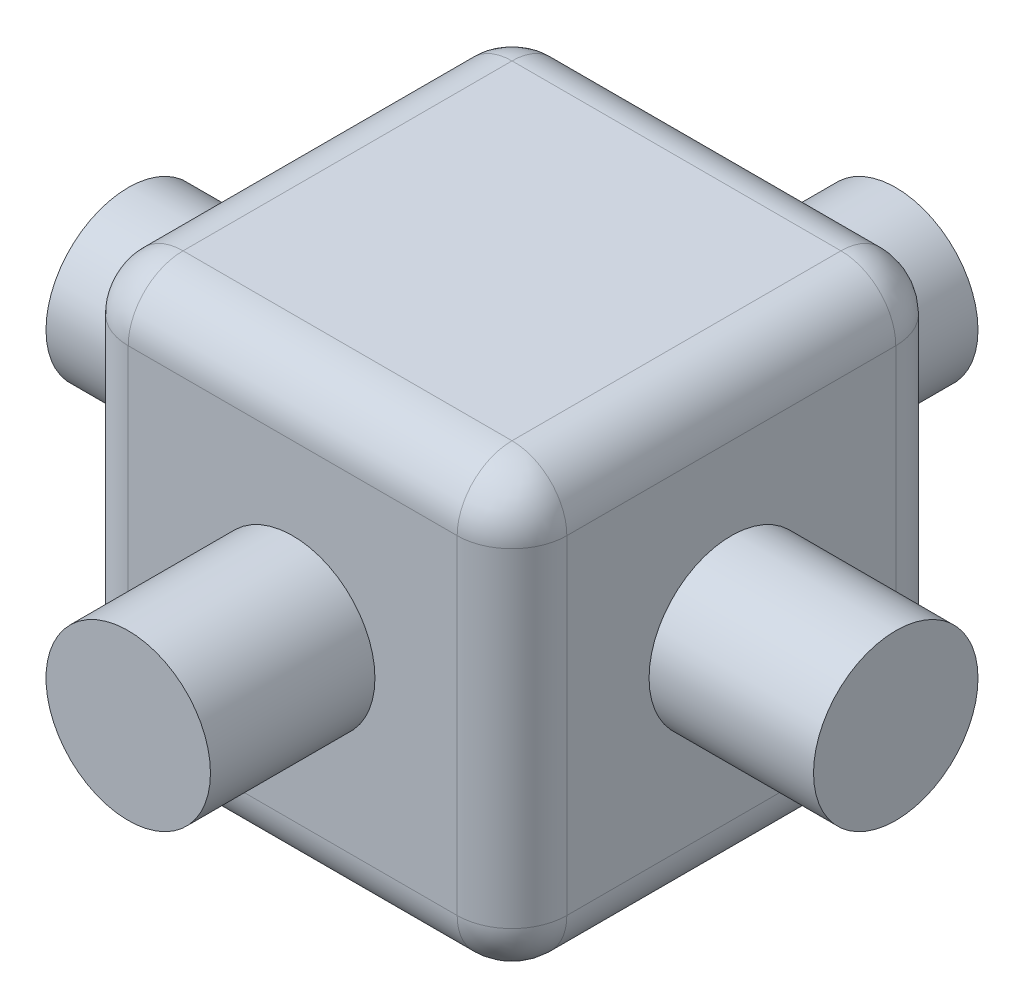
ISO-10303-21;
HEADER;
FILE_DESCRIPTION(('STEP AP214'),'2;1');
FILE_NAME('part.step','',(''),(''),'','','');
FILE_SCHEMA(('AUTOMOTIVE_DESIGN { 1 0 10303 214 1 1 1 1 }'));
ENDSEC;
DATA;
#1=APPLICATION_CONTEXT('core data for automotive mechanical design processes');
#2=APPLICATION_PROTOCOL_DEFINITION('international standard','automotive_design',2000,#1);
#3=PRODUCT_CONTEXT('',#1,'mechanical');
#4=PRODUCT('Part','Part','',(#3));
#5=PRODUCT_RELATED_PRODUCT_CATEGORY('part','',(#4));
#6=PRODUCT_DEFINITION_FORMATION('','',#4);
#7=PRODUCT_DEFINITION_CONTEXT('part definition',#1,'design');
#8=PRODUCT_DEFINITION('design','',#6,#7);
#9=PRODUCT_DEFINITION_SHAPE('','',#8);
#10=(LENGTH_UNIT() NAMED_UNIT(*) SI_UNIT(.MILLI.,.METRE.));
#11=(NAMED_UNIT(*) PLANE_ANGLE_UNIT() SI_UNIT($,.RADIAN.));
#12=(NAMED_UNIT(*) SI_UNIT($,.STERADIAN.) SOLID_ANGLE_UNIT());
#13=UNCERTAINTY_MEASURE_WITH_UNIT(LENGTH_MEASURE(1.E-05),#10,'distance_accuracy_value','');
#14=(GEOMETRIC_REPRESENTATION_CONTEXT(3) GLOBAL_UNCERTAINTY_ASSIGNED_CONTEXT((#13)) GLOBAL_UNIT_ASSIGNED_CONTEXT((#10,
#11,#12)) REPRESENTATION_CONTEXT('',''));
#15=CARTESIAN_POINT('',(0.,0.,0.));
#16=DIRECTION('',(0.,0.,1.));
#17=DIRECTION('',(1.,0.,0.));
#18=AXIS2_PLACEMENT_3D('',#15,#16,#17);
#19=CARTESIAN_POINT('',(0.,0.,3.5));
#20=DIRECTION('',(0.,0.,-1.));
#21=DIRECTION('',(-1.,0.,0.));
#22=AXIS2_PLACEMENT_3D('',#19,#20,#21);
#23=CYLINDRICAL_SURFACE('',#22,0.75);
#24=CARTESIAN_POINT('',(0.,0.,1.99999999999999));
#25=DIRECTION('',(0.,0.,1.));
#26=DIRECTION('',(1.,0.,0.));
#27=AXIS2_PLACEMENT_3D('',#24,#25,#26);
#28=CIRCLE('',#27,0.75);
#29=CARTESIAN_POINT('',(0.75,0.,1.99999999999999));
#30=VERTEX_POINT('',#29);
#31=EDGE_CURVE('E249',#30,#30,#28,.T.);
#32=ORIENTED_EDGE('',*,*,#31,.T.);
#33=EDGE_LOOP('',(#32));
#34=FACE_BOUND('',#33,.T.);
#35=CARTESIAN_POINT('',(0.,0.,3.5));
#36=DIRECTION('',(0.,0.,1.));
#37=DIRECTION('',(1.,0.,0.));
#38=AXIS2_PLACEMENT_3D('',#35,#36,#37);
#39=CIRCLE('',#38,0.75);
#40=CARTESIAN_POINT('',(0.75,0.,3.5));
#41=VERTEX_POINT('',#40);
#42=EDGE_CURVE('E446',#41,#41,#39,.T.);
#43=ORIENTED_EDGE('',*,*,#42,.F.);
#44=EDGE_LOOP('',(#43));
#45=FACE_BOUND('',#44,.T.);
#46=ADVANCED_FACE('F47',(#34,#45),#23,.T.);
#47=CARTESIAN_POINT('',(0.,0.,3.5));
#48=DIRECTION('',(0.,0.,1.));
#49=DIRECTION('',(1.,0.,0.));
#50=AXIS2_PLACEMENT_3D('',#47,#48,#49);
#51=PLANE('',#50);
#52=ORIENTED_EDGE('',*,*,#42,.T.);
#53=EDGE_LOOP('',(#52));
#54=FACE_BOUND('',#53,.T.);
#55=ADVANCED_FACE('F408',(#54),#51,.T.);
#56=CARTESIAN_POINT('',(0.,2.,1.99999999999999));
#57=DIRECTION('',(0.,0.,1.));
#58=DIRECTION('',(1.,0.,0.));
#59=AXIS2_PLACEMENT_3D('',#56,#57,#58);
#60=PLANE('',#59);
#61=DIRECTION('',(0.,-1.,0.));
#62=VECTOR('',#61,1.);
#63=CARTESIAN_POINT('',(-1.5,2.,1.99999999999999));
#64=LINE('',#63,#62);
#65=CARTESIAN_POINT('',(-1.5,1.5,1.99999999999999));
#66=VERTEX_POINT('',#65);
#67=CARTESIAN_POINT('',(-1.5,-1.5,1.99999999999999));
#68=VERTEX_POINT('',#67);
#69=EDGE_CURVE('E72',#66,#68,#64,.T.);
#70=ORIENTED_EDGE('',*,*,#69,.T.);
#71=DIRECTION('',(-1.,0.,0.));
#72=VECTOR('',#71,1.);
#73=CARTESIAN_POINT('',(2.,-1.5,1.99999999999999));
#74=LINE('',#73,#72);
#75=CARTESIAN_POINT('',(1.5,-1.5,1.99999999999999));
#76=VERTEX_POINT('',#75);
#77=EDGE_CURVE('E11',#68,#76,#74,.F.);
#78=ORIENTED_EDGE('',*,*,#77,.T.);
#79=DIRECTION('',(0.,-1.,0.));
#80=VECTOR('',#79,1.);
#81=CARTESIAN_POINT('',(1.5,2.,1.99999999999999));
#82=LINE('',#81,#80);
#83=CARTESIAN_POINT('',(1.5,1.5,1.99999999999999));
#84=VERTEX_POINT('',#83);
#85=EDGE_CURVE('E57',#76,#84,#82,.F.);
#86=ORIENTED_EDGE('',*,*,#85,.T.);
#87=DIRECTION('',(-1.,0.,0.));
#88=VECTOR('',#87,1.);
#89=CARTESIAN_POINT('',(0.,1.5,1.99999999999999));
#90=LINE('',#89,#88);
#91=EDGE_CURVE('E315',#84,#66,#90,.T.);
#92=ORIENTED_EDGE('',*,*,#91,.T.);
#93=EDGE_LOOP('',(#70,#78,#86,#92));
#94=FACE_BOUND('',#93,.T.);
#95=ORIENTED_EDGE('',*,*,#31,.F.);
#96=EDGE_LOOP('',(#95));
#97=FACE_BOUND('',#96,.T.);
#98=ADVANCED_FACE('F387',(#94,#97),#60,.T.);
#99=CARTESIAN_POINT('',(2.,2.,0.));
#100=DIRECTION('',(-1.,0.,0.));
#101=DIRECTION('',(0.,0.,1.));
#102=AXIS2_PLACEMENT_3D('',#99,#100,#101);
#103=PLANE('',#102);
#104=DIRECTION('',(0.,-1.,0.));
#105=VECTOR('',#104,1.);
#106=CARTESIAN_POINT('',(2.,-2.,1.49999999999999));
#107=LINE('',#106,#105);
#108=CARTESIAN_POINT('',(2.,1.5,1.49999999999999));
#109=VERTEX_POINT('',#108);
#110=CARTESIAN_POINT('',(2.,-1.5,1.49999999999999));
#111=VERTEX_POINT('',#110);
#112=EDGE_CURVE('E153',#109,#111,#107,.T.);
#113=ORIENTED_EDGE('',*,*,#112,.T.);
#114=DIRECTION('',(0.,0.,-1.));
#115=VECTOR('',#114,1.);
#116=CARTESIAN_POINT('',(2.,-1.5,0.));
#117=LINE('',#116,#115);
#118=CARTESIAN_POINT('',(2.,-1.5,-1.49999999999999));
#119=VERTEX_POINT('',#118);
#120=EDGE_CURVE('E148',#111,#119,#117,.T.);
#121=ORIENTED_EDGE('',*,*,#120,.T.);
#122=DIRECTION('',(0.,-1.,0.));
#123=VECTOR('',#122,1.);
#124=CARTESIAN_POINT('',(2.,2.,-1.49999999999999));
#125=LINE('',#124,#123);
#126=CARTESIAN_POINT('',(2.,1.5,-1.49999999999999));
#127=VERTEX_POINT('',#126);
#128=EDGE_CURVE('E141',#119,#127,#125,.F.);
#129=ORIENTED_EDGE('',*,*,#128,.T.);
#130=DIRECTION('',(0.,0.,-1.));
#131=VECTOR('',#130,1.);
#132=CARTESIAN_POINT('',(2.,1.5,1.99999999999999));
#133=LINE('',#132,#131);
#134=EDGE_CURVE('E145',#127,#109,#133,.F.);
#135=ORIENTED_EDGE('',*,*,#134,.T.);
#136=EDGE_LOOP('',(#113,#121,#129,#135));
#137=FACE_BOUND('',#136,.T.);
#138=CARTESIAN_POINT('',(2.,0.,0.));
#139=DIRECTION('',(-1.,0.,0.));
#140=DIRECTION('',(0.,0.,1.));
#141=AXIS2_PLACEMENT_3D('',#138,#139,#140);
#142=CIRCLE('',#141,0.75);
#143=CARTESIAN_POINT('',(2.,0.,0.749999999999993));
#144=VERTEX_POINT('',#143);
#145=EDGE_CURVE('E443',#144,#144,#142,.T.);
#146=ORIENTED_EDGE('',*,*,#145,.T.);
#147=EDGE_LOOP('',(#146));
#148=FACE_BOUND('',#147,.T.);
#149=ADVANCED_FACE('F143',(#137,#148),#103,.F.);
#150=CARTESIAN_POINT('',(0.,2.,-1.99999999999999));
#151=DIRECTION('',(0.,0.,1.));
#152=DIRECTION('',(1.,0.,0.));
#153=AXIS2_PLACEMENT_3D('',#150,#151,#152);
#154=PLANE('',#153);
#155=DIRECTION('',(0.,-1.,0.));
#156=VECTOR('',#155,1.);
#157=CARTESIAN_POINT('',(1.5,2.,-1.99999999999999));
#158=LINE('',#157,#156);
#159=CARTESIAN_POINT('',(1.5,1.5,-1.99999999999999));
#160=VERTEX_POINT('',#159);
#161=CARTESIAN_POINT('',(1.5,-1.5,-1.99999999999999));
#162=VERTEX_POINT('',#161);
#163=EDGE_CURVE('E178',#160,#162,#158,.T.);
#164=ORIENTED_EDGE('',*,*,#163,.T.);
#165=DIRECTION('',(-1.,0.,0.));
#166=VECTOR('',#165,1.);
#167=CARTESIAN_POINT('',(0.,-1.5,-1.99999999999999));
#168=LINE('',#167,#166);
#169=CARTESIAN_POINT('',(-1.5,-1.5,-1.99999999999999));
#170=VERTEX_POINT('',#169);
#171=EDGE_CURVE('E285',#162,#170,#168,.T.);
#172=ORIENTED_EDGE('',*,*,#171,.T.);
#173=DIRECTION('',(0.,-1.,0.));
#174=VECTOR('',#173,1.);
#175=CARTESIAN_POINT('',(-1.5,2.,-1.99999999999999));
#176=LINE('',#175,#174);
#177=CARTESIAN_POINT('',(-1.5,1.5,-1.99999999999999));
#178=VERTEX_POINT('',#177);
#179=EDGE_CURVE('E282',#170,#178,#176,.F.);
#180=ORIENTED_EDGE('',*,*,#179,.T.);
#181=DIRECTION('',(-1.,0.,0.));
#182=VECTOR('',#181,1.);
#183=CARTESIAN_POINT('',(2.,1.5,-1.99999999999999));
#184=LINE('',#183,#182);
#185=EDGE_CURVE('E277',#178,#160,#184,.F.);
#186=ORIENTED_EDGE('',*,*,#185,.T.);
#187=EDGE_LOOP('',(#164,#172,#180,#186));
#188=FACE_BOUND('',#187,.T.);
#189=CARTESIAN_POINT('',(0.,0.,-1.99999999999999));
#190=DIRECTION('',(0.,0.,1.));
#191=DIRECTION('',(1.,0.,0.));
#192=AXIS2_PLACEMENT_3D('',#189,#190,#191);
#193=CIRCLE('',#192,0.75);
#194=CARTESIAN_POINT('',(0.75,0.,-1.99999999999999));
#195=VERTEX_POINT('',#194);
#196=EDGE_CURVE('E166',#195,#195,#193,.T.);
#197=ORIENTED_EDGE('',*,*,#196,.T.);
#198=EDGE_LOOP('',(#197));
#199=FACE_BOUND('',#198,.T.);
#200=ADVANCED_FACE('F361',(#188,#199),#154,.F.);
#201=CARTESIAN_POINT('',(-2.,2.,0.));
#202=DIRECTION('',(-1.,0.,0.));
#203=DIRECTION('',(0.,0.,1.));
#204=AXIS2_PLACEMENT_3D('',#201,#202,#203);
#205=PLANE('',#204);
#206=DIRECTION('',(0.,0.,-1.));
#207=VECTOR('',#206,1.);
#208=CARTESIAN_POINT('',(-2.,1.5,0.));
#209=LINE('',#208,#207);
#210=CARTESIAN_POINT('',(-2.,1.5,1.49999999999999));
#211=VERTEX_POINT('',#210);
#212=CARTESIAN_POINT('',(-2.,1.5,-1.49999999999999));
#213=VERTEX_POINT('',#212);
#214=EDGE_CURVE('E295',#211,#213,#209,.T.);
#215=ORIENTED_EDGE('',*,*,#214,.T.);
#216=DIRECTION('',(0.,-1.,0.));
#217=VECTOR('',#216,1.);
#218=CARTESIAN_POINT('',(-2.,-2.,-1.49999999999999));
#219=LINE('',#218,#217);
#220=CARTESIAN_POINT('',(-2.,-1.5,-1.49999999999999));
#221=VERTEX_POINT('',#220);
#222=EDGE_CURVE('E298',#213,#221,#219,.T.);
#223=ORIENTED_EDGE('',*,*,#222,.T.);
#224=DIRECTION('',(0.,0.,-1.));
#225=VECTOR('',#224,1.);
#226=CARTESIAN_POINT('',(-2.,-1.5,1.99999999999999));
#227=LINE('',#226,#225);
#228=CARTESIAN_POINT('',(-2.,-1.5,1.49999999999999));
#229=VERTEX_POINT('',#228);
#230=EDGE_CURVE('E292',#221,#229,#227,.F.);
#231=ORIENTED_EDGE('',*,*,#230,.T.);
#232=DIRECTION('',(0.,-1.,0.));
#233=VECTOR('',#232,1.);
#234=CARTESIAN_POINT('',(-2.,2.,1.49999999999999));
#235=LINE('',#234,#233);
#236=EDGE_CURVE('E289',#229,#211,#235,.F.);
#237=ORIENTED_EDGE('',*,*,#236,.T.);
#238=EDGE_LOOP('',(#215,#223,#231,#237));
#239=FACE_BOUND('',#238,.T.);
#240=CARTESIAN_POINT('',(-2.,0.,0.));
#241=DIRECTION('',(-1.,0.,0.));
#242=DIRECTION('',(0.,0.,1.));
#243=AXIS2_PLACEMENT_3D('',#240,#241,#242);
#244=CIRCLE('',#243,0.75);
#245=CARTESIAN_POINT('',(-2.,0.,0.750000000000007));
#246=VERTEX_POINT('',#245);
#247=EDGE_CURVE('E242',#246,#246,#244,.T.);
#248=ORIENTED_EDGE('',*,*,#247,.F.);
#249=EDGE_LOOP('',(#248));
#250=FACE_BOUND('',#249,.T.);
#251=ADVANCED_FACE('F374',(#239,#250),#205,.T.);
#252=CARTESIAN_POINT('',(0.,2.,0.));
#253=DIRECTION('',(0.,1.,0.));
#254=DIRECTION('',(0.,0.,1.));
#255=AXIS2_PLACEMENT_3D('',#252,#253,#254);
#256=PLANE('',#255);
#257=DIRECTION('',(-1.,0.,0.));
#258=VECTOR('',#257,1.);
#259=CARTESIAN_POINT('',(-2.,2.,-1.49999999999999));
#260=LINE('',#259,#258);
#261=CARTESIAN_POINT('',(1.5,2.,-1.49999999999999));
#262=VERTEX_POINT('',#261);
#263=CARTESIAN_POINT('',(-1.5,2.,-1.49999999999999));
#264=VERTEX_POINT('',#263);
#265=EDGE_CURVE('E305',#262,#264,#260,.T.);
#266=ORIENTED_EDGE('',*,*,#265,.T.);
#267=DIRECTION('',(0.,0.,-1.));
#268=VECTOR('',#267,1.);
#269=CARTESIAN_POINT('',(-1.5,2.,0.));
#270=LINE('',#269,#268);
#271=CARTESIAN_POINT('',(-1.5,2.,1.49999999999999));
#272=VERTEX_POINT('',#271);
#273=EDGE_CURVE('E311',#264,#272,#270,.F.);
#274=ORIENTED_EDGE('',*,*,#273,.T.);
#275=DIRECTION('',(-1.,0.,0.));
#276=VECTOR('',#275,1.);
#277=CARTESIAN_POINT('',(0.,2.,1.49999999999999));
#278=LINE('',#277,#276);
#279=CARTESIAN_POINT('',(1.5,2.,1.49999999999999));
#280=VERTEX_POINT('',#279);
#281=EDGE_CURVE('E308',#272,#280,#278,.F.);
#282=ORIENTED_EDGE('',*,*,#281,.T.);
#283=DIRECTION('',(0.,0.,-1.));
#284=VECTOR('',#283,1.);
#285=CARTESIAN_POINT('',(1.5,2.,-1.99999999999999));
#286=LINE('',#285,#284);
#287=EDGE_CURVE('E302',#280,#262,#286,.T.);
#288=ORIENTED_EDGE('',*,*,#287,.T.);
#289=EDGE_LOOP('',(#266,#274,#282,#288));
#290=FACE_BOUND('',#289,.T.);
#291=ADVANCED_FACE('F370',(#290),#256,.T.);
#292=CARTESIAN_POINT('',(0.,-2.,0.));
#293=DIRECTION('',(0.,1.,0.));
#294=DIRECTION('',(0.,0.,1.));
#295=AXIS2_PLACEMENT_3D('',#292,#293,#294);
#296=PLANE('',#295);
#297=DIRECTION('',(-1.,0.,0.));
#298=VECTOR('',#297,1.);
#299=CARTESIAN_POINT('',(0.,-2.,-1.49999999999999));
#300=LINE('',#299,#298);
#301=CARTESIAN_POINT('',(-1.5,-2.,-1.49999999999999));
#302=VERTEX_POINT('',#301);
#303=CARTESIAN_POINT('',(1.5,-2.,-1.49999999999999));
#304=VERTEX_POINT('',#303);
#305=EDGE_CURVE('E270',#302,#304,#300,.F.);
#306=ORIENTED_EDGE('',*,*,#305,.T.);
#307=DIRECTION('',(0.,0.,-1.));
#308=VECTOR('',#307,1.);
#309=CARTESIAN_POINT('',(1.5,-2.,0.));
#310=LINE('',#309,#308);
#311=CARTESIAN_POINT('',(1.5,-2.,1.49999999999999));
#312=VERTEX_POINT('',#311);
#313=EDGE_CURVE('E273',#304,#312,#310,.F.);
#314=ORIENTED_EDGE('',*,*,#313,.T.);
#315=DIRECTION('',(-1.,0.,0.));
#316=VECTOR('',#315,1.);
#317=CARTESIAN_POINT('',(-2.,-2.,1.49999999999999));
#318=LINE('',#317,#316);
#319=CARTESIAN_POINT('',(-1.5,-2.,1.49999999999999));
#320=VERTEX_POINT('',#319);
#321=EDGE_CURVE('E264',#312,#320,#318,.T.);
#322=ORIENTED_EDGE('',*,*,#321,.T.);
#323=DIRECTION('',(0.,0.,-1.));
#324=VECTOR('',#323,1.);
#325=CARTESIAN_POINT('',(-1.5,-2.,-1.99999999999999));
#326=LINE('',#325,#324);
#327=EDGE_CURVE('E267',#320,#302,#326,.T.);
#328=ORIENTED_EDGE('',*,*,#327,.T.);
#329=EDGE_LOOP('',(#306,#314,#322,#328));
#330=FACE_BOUND('',#329,.T.);
#331=ADVANCED_FACE('F348',(#330),#296,.F.);
#332=CARTESIAN_POINT('',(3.5,0.,0.));
#333=DIRECTION('',(1.,0.,0.));
#334=DIRECTION('',(0.,0.,-1.));
#335=AXIS2_PLACEMENT_3D('',#332,#333,#334);
#336=PLANE('',#335);
#337=CARTESIAN_POINT('',(3.5,0.,0.));
#338=DIRECTION('',(1.,0.,0.));
#339=DIRECTION('',(0.,0.,-1.));
#340=AXIS2_PLACEMENT_3D('',#337,#338,#339);
#341=CIRCLE('',#340,0.75);
#342=CARTESIAN_POINT('',(3.5,0.,-0.750000000000012));
#343=VERTEX_POINT('',#342);
#344=EDGE_CURVE('E453',#343,#343,#341,.T.);
#345=ORIENTED_EDGE('',*,*,#344,.T.);
#346=EDGE_LOOP('',(#345));
#347=FACE_BOUND('',#346,.T.);
#348=ADVANCED_FACE('F462',(#347),#336,.T.);
#349=CARTESIAN_POINT('',(3.5,0.,0.));
#350=DIRECTION('',(-1.,0.,0.));
#351=DIRECTION('',(0.,0.,1.));
#352=AXIS2_PLACEMENT_3D('',#349,#350,#351);
#353=CYLINDRICAL_SURFACE('',#352,0.75);
#354=ORIENTED_EDGE('',*,*,#344,.F.);
#355=EDGE_LOOP('',(#354));
#356=FACE_BOUND('',#355,.T.);
#357=ORIENTED_EDGE('',*,*,#145,.F.);
#358=EDGE_LOOP('',(#357));
#359=FACE_BOUND('',#358,.T.);
#360=ADVANCED_FACE('F434',(#356,#359),#353,.T.);
#361=CARTESIAN_POINT('',(0.,0.,-3.5));
#362=DIRECTION('',(0.,0.,1.));
#363=DIRECTION('',(1.,0.,0.));
#364=AXIS2_PLACEMENT_3D('',#361,#362,#363);
#365=PLANE('',#364);
#366=CARTESIAN_POINT('',(0.,0.,-3.5));
#367=DIRECTION('',(0.,0.,1.));
#368=DIRECTION('',(1.,0.,0.));
#369=AXIS2_PLACEMENT_3D('',#366,#367,#368);
#370=CIRCLE('',#369,0.75);
#371=CARTESIAN_POINT('',(0.75,0.,-3.5));
#372=VERTEX_POINT('',#371);
#373=EDGE_CURVE('E439',#372,#372,#370,.T.);
#374=ORIENTED_EDGE('',*,*,#373,.F.);
#375=EDGE_LOOP('',(#374));
#376=FACE_BOUND('',#375,.T.);
#377=ADVANCED_FACE('F424',(#376),#365,.F.);
#378=ORIENTED_EDGE('',*,*,#373,.T.);
#379=EDGE_LOOP('',(#378));
#380=FACE_BOUND('',#379,.T.);
#381=ORIENTED_EDGE('',*,*,#196,.F.);
#382=EDGE_LOOP('',(#381));
#383=FACE_BOUND('',#382,.T.);
#384=ADVANCED_FACE('F411',(#380,#383),#23,.T.);
#385=CARTESIAN_POINT('',(-3.5,0.,0.));
#386=DIRECTION('',(1.,0.,0.));
#387=DIRECTION('',(0.,0.,-1.));
#388=AXIS2_PLACEMENT_3D('',#385,#386,#387);
#389=PLANE('',#388);
#390=CARTESIAN_POINT('',(-3.5,0.,0.));
#391=DIRECTION('',(1.,0.,0.));
#392=DIRECTION('',(0.,0.,-1.));
#393=AXIS2_PLACEMENT_3D('',#390,#391,#392);
#394=CIRCLE('',#393,0.75);
#395=CARTESIAN_POINT('',(-3.5,0.,-0.749999999999988));
#396=VERTEX_POINT('',#395);
#397=EDGE_CURVE('E255',#396,#396,#394,.T.);
#398=ORIENTED_EDGE('',*,*,#397,.F.);
#399=EDGE_LOOP('',(#398));
#400=FACE_BOUND('',#399,.T.);
#401=ADVANCED_FACE('F423',(#400),#389,.F.);
#402=ORIENTED_EDGE('',*,*,#247,.T.);
#403=EDGE_LOOP('',(#402));
#404=FACE_BOUND('',#403,.T.);
#405=ORIENTED_EDGE('',*,*,#397,.T.);
#406=EDGE_LOOP('',(#405));
#407=FACE_BOUND('',#406,.T.);
#408=ADVANCED_FACE('F430',(#404,#407),#353,.T.);
#409=CARTESIAN_POINT('',(-1.5,1.5,0.));
#410=DIRECTION('',(0.,0.,-1.));
#411=DIRECTION('',(-1.,0.,0.));
#412=AXIS2_PLACEMENT_3D('',#409,#410,#411);
#413=CYLINDRICAL_SURFACE('',#412,0.5);
#414=CARTESIAN_POINT('',(-1.5,1.5,1.49999999999999));
#415=DIRECTION('',(0.,0.,1.));
#416=DIRECTION('',(1.,0.,0.));
#417=AXIS2_PLACEMENT_3D('',#414,#415,#416);
#418=CIRCLE('',#417,0.5);
#419=EDGE_CURVE('E51',#272,#211,#418,.T.);
#420=ORIENTED_EDGE('',*,*,#419,.F.);
#421=ORIENTED_EDGE('',*,*,#273,.F.);
#422=CARTESIAN_POINT('',(-1.5,1.5,-1.49999999999999));
#423=DIRECTION('',(0.,0.,-1.));
#424=DIRECTION('',(-1.,0.,0.));
#425=AXIS2_PLACEMENT_3D('',#422,#423,#424);
#426=CIRCLE('',#425,0.5);
#427=EDGE_CURVE('E233',#213,#264,#426,.T.);
#428=ORIENTED_EDGE('',*,*,#427,.F.);
#429=ORIENTED_EDGE('',*,*,#214,.F.);
#430=EDGE_LOOP('',(#420,#421,#428,#429));
#431=FACE_BOUND('',#430,.T.);
#432=ADVANCED_FACE('F49',(#431),#413,.T.);
#433=CARTESIAN_POINT('',(-1.5,1.5,1.49999999999999));
#434=DIRECTION('',(-1.,0.,0.));
#435=DIRECTION('',(0.,0.,1.));
#436=AXIS2_PLACEMENT_3D('',#433,#434,#435);
#437=SPHERICAL_SURFACE('',#436,0.5);
#438=CARTESIAN_POINT('',(-1.5,1.5,1.49999999999999));
#439=DIRECTION('',(-1.,0.,0.));
#440=DIRECTION('',(0.,0.,1.));
#441=AXIS2_PLACEMENT_3D('',#438,#439,#440);
#442=CIRCLE('',#441,0.5);
#443=EDGE_CURVE('E226',#272,#66,#442,.F.);
#444=ORIENTED_EDGE('',*,*,#443,.F.);
#445=ORIENTED_EDGE('',*,*,#419,.T.);
#446=CARTESIAN_POINT('',(-1.5,1.5,1.49999999999999));
#447=DIRECTION('',(0.,1.,0.));
#448=DIRECTION('',(0.,0.,1.));
#449=AXIS2_PLACEMENT_3D('',#446,#447,#448);
#450=CIRCLE('',#449,0.5);
#451=EDGE_CURVE('E230',#66,#211,#450,.F.);
#452=ORIENTED_EDGE('',*,*,#451,.F.);
#453=EDGE_LOOP('',(#444,#445,#452));
#454=FACE_BOUND('',#453,.T.);
#455=ADVANCED_FACE('F473',(#454),#437,.T.);
#456=CARTESIAN_POINT('',(-1.5,1.5,-1.49999999999999));
#457=DIRECTION('',(0.,1.,0.));
#458=DIRECTION('',(0.,0.,1.));
#459=AXIS2_PLACEMENT_3D('',#456,#457,#458);
#460=SPHERICAL_SURFACE('',#459,0.5);
#461=CARTESIAN_POINT('',(-1.5,1.5,-1.49999999999999));
#462=DIRECTION('',(0.,1.,0.));
#463=DIRECTION('',(0.,0.,1.));
#464=AXIS2_PLACEMENT_3D('',#461,#462,#463);
#465=CIRCLE('',#464,0.5);
#466=EDGE_CURVE('E218',#213,#178,#465,.F.);
#467=ORIENTED_EDGE('',*,*,#466,.F.);
#468=ORIENTED_EDGE('',*,*,#427,.T.);
#469=CARTESIAN_POINT('',(-1.5,1.5,-1.49999999999999));
#470=DIRECTION('',(-1.,0.,0.));
#471=DIRECTION('',(0.,0.,1.));
#472=AXIS2_PLACEMENT_3D('',#469,#470,#471);
#473=CIRCLE('',#472,0.5);
#474=EDGE_CURVE('E222',#178,#264,#473,.F.);
#475=ORIENTED_EDGE('',*,*,#474,.F.);
#476=EDGE_LOOP('',(#467,#468,#475));
#477=FACE_BOUND('',#476,.T.);
#478=ADVANCED_FACE('F480',(#477),#460,.T.);
#479=CARTESIAN_POINT('',(-1.5,2.,1.49999999999999));
#480=DIRECTION('',(0.,-1.,0.));
#481=DIRECTION('',(0.,0.,-1.));
#482=AXIS2_PLACEMENT_3D('',#479,#480,#481);
#483=CYLINDRICAL_SURFACE('',#482,0.5);
#484=ORIENTED_EDGE('',*,*,#451,.T.);
#485=ORIENTED_EDGE('',*,*,#236,.F.);
#486=CARTESIAN_POINT('',(-1.5,-1.5,1.49999999999999));
#487=DIRECTION('',(0.,-1.,0.));
#488=DIRECTION('',(0.,0.,-1.));
#489=AXIS2_PLACEMENT_3D('',#486,#487,#488);
#490=CIRCLE('',#489,0.5);
#491=EDGE_CURVE('E210',#68,#229,#490,.T.);
#492=ORIENTED_EDGE('',*,*,#491,.F.);
#493=ORIENTED_EDGE('',*,*,#69,.F.);
#494=EDGE_LOOP('',(#484,#485,#492,#493));
#495=FACE_BOUND('',#494,.T.);
#496=ADVANCED_FACE('F381',(#495),#483,.T.);
#497=CARTESIAN_POINT('',(0.,1.5,1.49999999999999));
#498=DIRECTION('',(-1.,0.,0.));
#499=DIRECTION('',(0.,0.,1.));
#500=AXIS2_PLACEMENT_3D('',#497,#498,#499);
#501=CYLINDRICAL_SURFACE('',#500,0.5);
#502=ORIENTED_EDGE('',*,*,#443,.T.);
#503=ORIENTED_EDGE('',*,*,#91,.F.);
#504=CARTESIAN_POINT('',(1.5,1.5,1.49999999999999));
#505=DIRECTION('',(1.,0.,0.));
#506=DIRECTION('',(0.,0.,-1.));
#507=AXIS2_PLACEMENT_3D('',#504,#505,#506);
#508=CIRCLE('',#507,0.5);
#509=EDGE_CURVE('E206',#280,#84,#508,.T.);
#510=ORIENTED_EDGE('',*,*,#509,.F.);
#511=ORIENTED_EDGE('',*,*,#281,.F.);
#512=EDGE_LOOP('',(#502,#503,#510,#511));
#513=FACE_BOUND('',#512,.T.);
#514=ADVANCED_FACE('F393',(#513),#501,.T.);
#515=CARTESIAN_POINT('',(1.5,1.5,0.));
#516=DIRECTION('',(0.,0.,1.));
#517=DIRECTION('',(1.,0.,0.));
#518=AXIS2_PLACEMENT_3D('',#515,#516,#517);
#519=CYLINDRICAL_SURFACE('',#518,0.5);
#520=CARTESIAN_POINT('',(1.5,1.5,-1.49999999999999));
#521=DIRECTION('',(0.,0.,-1.));
#522=DIRECTION('',(-1.,0.,0.));
#523=AXIS2_PLACEMENT_3D('',#520,#521,#522);
#524=CIRCLE('',#523,0.5);
#525=EDGE_CURVE('E160',#262,#127,#524,.T.);
#526=ORIENTED_EDGE('',*,*,#525,.F.);
#527=ORIENTED_EDGE('',*,*,#287,.F.);
#528=CARTESIAN_POINT('',(1.5,1.5,1.49999999999999));
#529=DIRECTION('',(0.,0.,1.));
#530=DIRECTION('',(1.,0.,0.));
#531=AXIS2_PLACEMENT_3D('',#528,#529,#530);
#532=CIRCLE('',#531,0.5);
#533=EDGE_CURVE('E163',#109,#280,#532,.T.);
#534=ORIENTED_EDGE('',*,*,#533,.F.);
#535=ORIENTED_EDGE('',*,*,#134,.F.);
#536=EDGE_LOOP('',(#526,#527,#534,#535));
#537=FACE_BOUND('',#536,.T.);
#538=ADVANCED_FACE('F158',(#537),#519,.T.);
#539=CARTESIAN_POINT('',(0.,1.5,-1.49999999999999));
#540=DIRECTION('',(1.,0.,0.));
#541=DIRECTION('',(0.,0.,-1.));
#542=AXIS2_PLACEMENT_3D('',#539,#540,#541);
#543=CYLINDRICAL_SURFACE('',#542,0.5);
#544=ORIENTED_EDGE('',*,*,#474,.T.);
#545=ORIENTED_EDGE('',*,*,#265,.F.);
#546=CARTESIAN_POINT('',(1.5,1.5,-1.49999999999999));
#547=DIRECTION('',(1.,0.,0.));
#548=DIRECTION('',(0.,0.,-1.));
#549=AXIS2_PLACEMENT_3D('',#546,#547,#548);
#550=CIRCLE('',#549,0.5);
#551=EDGE_CURVE('E174',#160,#262,#550,.T.);
#552=ORIENTED_EDGE('',*,*,#551,.F.);
#553=ORIENTED_EDGE('',*,*,#185,.F.);
#554=EDGE_LOOP('',(#544,#545,#552,#553));
#555=FACE_BOUND('',#554,.T.);
#556=ADVANCED_FACE('F367',(#555),#543,.T.);
#557=CARTESIAN_POINT('',(-1.5,2.,-1.49999999999999));
#558=DIRECTION('',(0.,1.,0.));
#559=DIRECTION('',(0.,0.,1.));
#560=AXIS2_PLACEMENT_3D('',#557,#558,#559);
#561=CYLINDRICAL_SURFACE('',#560,0.5);
#562=ORIENTED_EDGE('',*,*,#466,.T.);
#563=ORIENTED_EDGE('',*,*,#179,.F.);
#564=CARTESIAN_POINT('',(-1.5,-1.5,-1.49999999999999));
#565=DIRECTION('',(0.,-1.,0.));
#566=DIRECTION('',(0.,0.,-1.));
#567=AXIS2_PLACEMENT_3D('',#564,#565,#566);
#568=CIRCLE('',#567,0.5);
#569=EDGE_CURVE('E198',#221,#170,#568,.T.);
#570=ORIENTED_EDGE('',*,*,#569,.F.);
#571=ORIENTED_EDGE('',*,*,#222,.F.);
#572=EDGE_LOOP('',(#562,#563,#570,#571));
#573=FACE_BOUND('',#572,.T.);
#574=ADVANCED_FACE('F494',(#573),#561,.T.);
#575=CARTESIAN_POINT('',(-1.5,-1.5,0.));
#576=DIRECTION('',(0.,0.,1.));
#577=DIRECTION('',(1.,0.,0.));
#578=AXIS2_PLACEMENT_3D('',#575,#576,#577);
#579=CYLINDRICAL_SURFACE('',#578,0.5);
#580=CARTESIAN_POINT('',(-1.5,-1.5,1.49999999999999));
#581=DIRECTION('',(0.,0.,1.));
#582=DIRECTION('',(1.,0.,0.));
#583=AXIS2_PLACEMENT_3D('',#580,#581,#582);
#584=CIRCLE('',#583,0.5);
#585=EDGE_CURVE('E214',#229,#320,#584,.T.);
#586=ORIENTED_EDGE('',*,*,#585,.F.);
#587=ORIENTED_EDGE('',*,*,#230,.F.);
#588=CARTESIAN_POINT('',(-1.5,-1.5,-1.49999999999999));
#589=DIRECTION('',(0.,0.,-1.));
#590=DIRECTION('',(-1.,0.,0.));
#591=AXIS2_PLACEMENT_3D('',#588,#589,#590);
#592=CIRCLE('',#591,0.5);
#593=EDGE_CURVE('E195',#302,#221,#592,.T.);
#594=ORIENTED_EDGE('',*,*,#593,.F.);
#595=ORIENTED_EDGE('',*,*,#327,.F.);
#596=EDGE_LOOP('',(#586,#587,#594,#595));
#597=FACE_BOUND('',#596,.T.);
#598=ADVANCED_FACE('F383',(#597),#579,.T.);
#599=CARTESIAN_POINT('',(-1.5,-1.5,1.49999999999999));
#600=DIRECTION('',(-1.,0.,0.));
#601=DIRECTION('',(0.,0.,1.));
#602=AXIS2_PLACEMENT_3D('',#599,#600,#601);
#603=SPHERICAL_SURFACE('',#602,0.5);
#604=ORIENTED_EDGE('',*,*,#491,.T.);
#605=ORIENTED_EDGE('',*,*,#585,.T.);
#606=CARTESIAN_POINT('',(-1.5,-1.5,1.49999999999999));
#607=DIRECTION('',(-1.,0.,0.));
#608=DIRECTION('',(0.,0.,1.));
#609=AXIS2_PLACEMENT_3D('',#606,#607,#608);
#610=CIRCLE('',#609,0.5);
#611=EDGE_CURVE('E186',#68,#320,#610,.F.);
#612=ORIENTED_EDGE('',*,*,#611,.F.);
#613=EDGE_LOOP('',(#604,#605,#612));
#614=FACE_BOUND('',#613,.T.);
#615=ADVANCED_FACE('F386',(#614),#603,.T.);
#616=CARTESIAN_POINT('',(1.5,1.5,1.49999999999999));
#617=DIRECTION('',(0.,1.,0.));
#618=DIRECTION('',(0.,0.,1.));
#619=AXIS2_PLACEMENT_3D('',#616,#617,#618);
#620=SPHERICAL_SURFACE('',#619,0.5);
#621=ORIENTED_EDGE('',*,*,#533,.T.);
#622=ORIENTED_EDGE('',*,*,#509,.T.);
#623=CARTESIAN_POINT('',(1.5,1.5,1.49999999999999));
#624=DIRECTION('',(0.,1.,0.));
#625=DIRECTION('',(0.,0.,1.));
#626=AXIS2_PLACEMENT_3D('',#623,#624,#625);
#627=CIRCLE('',#626,0.5);
#628=EDGE_CURVE('E180',#109,#84,#627,.F.);
#629=ORIENTED_EDGE('',*,*,#628,.F.);
#630=EDGE_LOOP('',(#621,#622,#629));
#631=FACE_BOUND('',#630,.T.);
#632=ADVANCED_FACE('F395',(#631),#620,.T.);
#633=CARTESIAN_POINT('',(1.5,1.5,-1.49999999999999));
#634=DIRECTION('',(0.,1.,0.));
#635=DIRECTION('',(0.,0.,1.));
#636=AXIS2_PLACEMENT_3D('',#633,#634,#635);
#637=SPHERICAL_SURFACE('',#636,0.5);
#638=ORIENTED_EDGE('',*,*,#551,.T.);
#639=ORIENTED_EDGE('',*,*,#525,.T.);
#640=CARTESIAN_POINT('',(1.5,1.5,-1.49999999999999));
#641=DIRECTION('',(0.,1.,0.));
#642=DIRECTION('',(0.,0.,1.));
#643=AXIS2_PLACEMENT_3D('',#640,#641,#642);
#644=CIRCLE('',#643,0.5);
#645=EDGE_CURVE('E171',#160,#127,#644,.F.);
#646=ORIENTED_EDGE('',*,*,#645,.F.);
#647=EDGE_LOOP('',(#638,#639,#646));
#648=FACE_BOUND('',#647,.T.);
#649=ADVANCED_FACE('F170',(#648),#637,.T.);
#650=CARTESIAN_POINT('',(-1.5,-1.5,-1.49999999999999));
#651=DIRECTION('',(-1.,0.,0.));
#652=DIRECTION('',(0.,0.,1.));
#653=AXIS2_PLACEMENT_3D('',#650,#651,#652);
#654=SPHERICAL_SURFACE('',#653,0.5);
#655=ORIENTED_EDGE('',*,*,#593,.T.);
#656=ORIENTED_EDGE('',*,*,#569,.T.);
#657=CARTESIAN_POINT('',(-1.5,-1.5,-1.49999999999999));
#658=DIRECTION('',(-1.,0.,0.));
#659=DIRECTION('',(0.,0.,1.));
#660=AXIS2_PLACEMENT_3D('',#657,#658,#659);
#661=CIRCLE('',#660,0.5);
#662=EDGE_CURVE('E181',#302,#170,#661,.F.);
#663=ORIENTED_EDGE('',*,*,#662,.F.);
#664=EDGE_LOOP('',(#655,#656,#663));
#665=FACE_BOUND('',#664,.T.);
#666=ADVANCED_FACE('F405',(#665),#654,.T.);
#667=CARTESIAN_POINT('',(0.,-1.5,1.49999999999999));
#668=DIRECTION('',(1.,0.,0.));
#669=DIRECTION('',(0.,0.,-1.));
#670=AXIS2_PLACEMENT_3D('',#667,#668,#669);
#671=CYLINDRICAL_SURFACE('',#670,0.5);
#672=ORIENTED_EDGE('',*,*,#611,.T.);
#673=ORIENTED_EDGE('',*,*,#321,.F.);
#674=CARTESIAN_POINT('',(1.5,-1.5,1.49999999999999));
#675=DIRECTION('',(1.,0.,0.));
#676=DIRECTION('',(0.,0.,-1.));
#677=AXIS2_PLACEMENT_3D('',#674,#675,#676);
#678=CIRCLE('',#677,0.5);
#679=EDGE_CURVE('E188',#76,#312,#678,.T.);
#680=ORIENTED_EDGE('',*,*,#679,.F.);
#681=ORIENTED_EDGE('',*,*,#77,.F.);
#682=EDGE_LOOP('',(#672,#673,#680,#681));
#683=FACE_BOUND('',#682,.T.);
#684=ADVANCED_FACE('F343',(#683),#671,.T.);
#685=CARTESIAN_POINT('',(1.5,2.,1.49999999999999));
#686=DIRECTION('',(0.,1.,0.));
#687=DIRECTION('',(0.,0.,1.));
#688=AXIS2_PLACEMENT_3D('',#685,#686,#687);
#689=CYLINDRICAL_SURFACE('',#688,0.5);
#690=ORIENTED_EDGE('',*,*,#628,.T.);
#691=ORIENTED_EDGE('',*,*,#85,.F.);
#692=CARTESIAN_POINT('',(1.5,-1.5,1.49999999999999));
#693=DIRECTION('',(0.,-1.,0.));
#694=DIRECTION('',(0.,0.,-1.));
#695=AXIS2_PLACEMENT_3D('',#692,#693,#694);
#696=CIRCLE('',#695,0.5);
#697=EDGE_CURVE('E65',#111,#76,#696,.T.);
#698=ORIENTED_EDGE('',*,*,#697,.F.);
#699=ORIENTED_EDGE('',*,*,#112,.F.);
#700=EDGE_LOOP('',(#690,#691,#698,#699));
#701=FACE_BOUND('',#700,.T.);
#702=ADVANCED_FACE('F397',(#701),#689,.T.);
#703=CARTESIAN_POINT('',(1.5,2.,-1.49999999999999));
#704=DIRECTION('',(0.,-1.,0.));
#705=DIRECTION('',(0.,0.,-1.));
#706=AXIS2_PLACEMENT_3D('',#703,#704,#705);
#707=CYLINDRICAL_SURFACE('',#706,0.5);
#708=ORIENTED_EDGE('',*,*,#645,.T.);
#709=ORIENTED_EDGE('',*,*,#128,.F.);
#710=CARTESIAN_POINT('',(1.5,-1.5,-1.49999999999999));
#711=DIRECTION('',(0.,-1.,0.));
#712=DIRECTION('',(0.,0.,-1.));
#713=AXIS2_PLACEMENT_3D('',#710,#711,#712);
#714=CIRCLE('',#713,0.5);
#715=EDGE_CURVE('E332',#162,#119,#714,.T.);
#716=ORIENTED_EDGE('',*,*,#715,.F.);
#717=ORIENTED_EDGE('',*,*,#163,.F.);
#718=EDGE_LOOP('',(#708,#709,#716,#717));
#719=FACE_BOUND('',#718,.T.);
#720=ADVANCED_FACE('F177',(#719),#707,.T.);
#721=CARTESIAN_POINT('',(0.,-1.5,-1.49999999999999));
#722=DIRECTION('',(-1.,0.,0.));
#723=DIRECTION('',(0.,0.,1.));
#724=AXIS2_PLACEMENT_3D('',#721,#722,#723);
#725=CYLINDRICAL_SURFACE('',#724,0.5);
#726=ORIENTED_EDGE('',*,*,#662,.T.);
#727=ORIENTED_EDGE('',*,*,#171,.F.);
#728=CARTESIAN_POINT('',(1.5,-1.5,-1.49999999999999));
#729=DIRECTION('',(1.,0.,0.));
#730=DIRECTION('',(0.,0.,-1.));
#731=AXIS2_PLACEMENT_3D('',#728,#729,#730);
#732=CIRCLE('',#731,0.5);
#733=EDGE_CURVE('E328',#304,#162,#732,.T.);
#734=ORIENTED_EDGE('',*,*,#733,.F.);
#735=ORIENTED_EDGE('',*,*,#305,.F.);
#736=EDGE_LOOP('',(#726,#727,#734,#735));
#737=FACE_BOUND('',#736,.T.);
#738=ADVANCED_FACE('F358',(#737),#725,.T.);
#739=CARTESIAN_POINT('',(1.5,-1.5,1.49999999999999));
#740=DIRECTION('',(0.,0.,1.));
#741=DIRECTION('',(1.,0.,0.));
#742=AXIS2_PLACEMENT_3D('',#739,#740,#741);
#743=SPHERICAL_SURFACE('',#742,0.5);
#744=ORIENTED_EDGE('',*,*,#697,.T.);
#745=ORIENTED_EDGE('',*,*,#679,.T.);
#746=CARTESIAN_POINT('',(1.5,-1.5,1.49999999999999));
#747=DIRECTION('',(0.,0.,1.));
#748=DIRECTION('',(1.,0.,0.));
#749=AXIS2_PLACEMENT_3D('',#746,#747,#748);
#750=CIRCLE('',#749,0.5);
#751=EDGE_CURVE('E325',#111,#312,#750,.F.);
#752=ORIENTED_EDGE('',*,*,#751,.F.);
#753=EDGE_LOOP('',(#744,#745,#752));
#754=FACE_BOUND('',#753,.T.);
#755=ADVANCED_FACE('F339',(#754),#743,.T.);
#756=CARTESIAN_POINT('',(1.5,-1.5,-1.49999999999999));
#757=DIRECTION('',(0.,0.,-1.));
#758=DIRECTION('',(-1.,0.,0.));
#759=AXIS2_PLACEMENT_3D('',#756,#757,#758);
#760=SPHERICAL_SURFACE('',#759,0.5);
#761=ORIENTED_EDGE('',*,*,#733,.T.);
#762=ORIENTED_EDGE('',*,*,#715,.T.);
#763=CARTESIAN_POINT('',(1.5,-1.5,-1.49999999999999));
#764=DIRECTION('',(0.,0.,-1.));
#765=DIRECTION('',(-1.,0.,0.));
#766=AXIS2_PLACEMENT_3D('',#763,#764,#765);
#767=CIRCLE('',#766,0.5);
#768=EDGE_CURVE('E322',#304,#119,#767,.F.);
#769=ORIENTED_EDGE('',*,*,#768,.F.);
#770=EDGE_LOOP('',(#761,#762,#769));
#771=FACE_BOUND('',#770,.T.);
#772=ADVANCED_FACE('F355',(#771),#760,.T.);
#773=CARTESIAN_POINT('',(1.5,-1.5,0.));
#774=DIRECTION('',(0.,0.,-1.));
#775=DIRECTION('',(-1.,0.,0.));
#776=AXIS2_PLACEMENT_3D('',#773,#774,#775);
#777=CYLINDRICAL_SURFACE('',#776,0.5);
#778=ORIENTED_EDGE('',*,*,#751,.T.);
#779=ORIENTED_EDGE('',*,*,#313,.F.);
#780=ORIENTED_EDGE('',*,*,#768,.T.);
#781=ORIENTED_EDGE('',*,*,#120,.F.);
#782=EDGE_LOOP('',(#778,#779,#780,#781));
#783=FACE_BOUND('',#782,.T.);
#784=ADVANCED_FACE('F353',(#783),#777,.T.);
#785=CLOSED_SHELL('',(#46,#55,#98,#149,#200,#251,#291,#331,#348,#360,#377,#384,#401,#408,#432,
#455,#478,#496,#514,#538,#556,#574,#598,#615,#632,#649,#666,#684,#702,#720,#738,#755,#772,#784));
#786=MANIFOLD_SOLID_BREP('B2',#785);
#787=ADVANCED_BREP_SHAPE_REPRESENTATION('',(#18,#786),#14);
#788=SHAPE_DEFINITION_REPRESENTATION(#9,#787);
ENDSEC;
END-ISO-10303-21;
